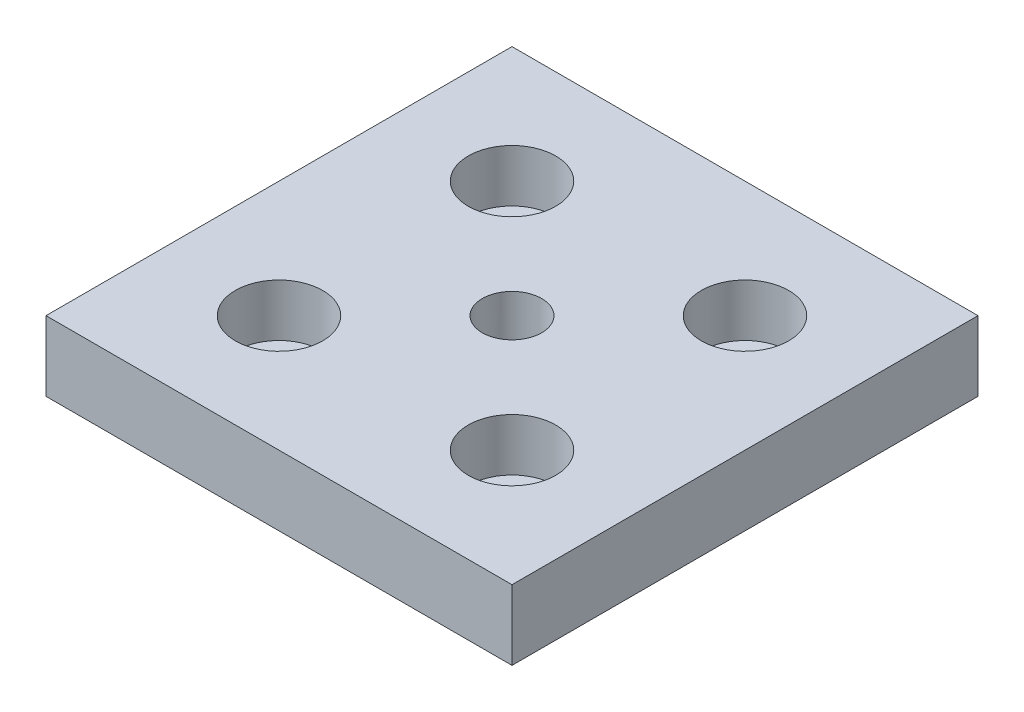
ISO-10303-21;
HEADER;
FILE_DESCRIPTION(('STEP AP214'),'2;1');
FILE_NAME('part.step','',(''),(''),'','','');
FILE_SCHEMA(('AUTOMOTIVE_DESIGN { 1 0 10303 214 1 1 1 1 }'));
ENDSEC;
DATA;
#1=APPLICATION_CONTEXT('core data for automotive mechanical design processes');
#2=APPLICATION_PROTOCOL_DEFINITION('international standard','automotive_design',2000,#1);
#3=PRODUCT_CONTEXT('',#1,'mechanical');
#4=PRODUCT('Part','Part','',(#3));
#5=PRODUCT_RELATED_PRODUCT_CATEGORY('part','',(#4));
#6=PRODUCT_DEFINITION_FORMATION('','',#4);
#7=PRODUCT_DEFINITION_CONTEXT('part definition',#1,'design');
#8=PRODUCT_DEFINITION('design','',#6,#7);
#9=PRODUCT_DEFINITION_SHAPE('','',#8);
#10=(LENGTH_UNIT() NAMED_UNIT(*) SI_UNIT(.MILLI.,.METRE.));
#11=(NAMED_UNIT(*) PLANE_ANGLE_UNIT() SI_UNIT($,.RADIAN.));
#12=(NAMED_UNIT(*) SI_UNIT($,.STERADIAN.) SOLID_ANGLE_UNIT());
#13=UNCERTAINTY_MEASURE_WITH_UNIT(LENGTH_MEASURE(1.E-05),#10,'distance_accuracy_value','');
#14=(GEOMETRIC_REPRESENTATION_CONTEXT(3) GLOBAL_UNCERTAINTY_ASSIGNED_CONTEXT((#13)) GLOBAL_UNIT_ASSIGNED_CONTEXT((#10,
#11,#12)) REPRESENTATION_CONTEXT('',''));
#15=CARTESIAN_POINT('',(0.,0.,0.));
#16=DIRECTION('',(0.,0.,1.));
#17=DIRECTION('',(1.,0.,0.));
#18=AXIS2_PLACEMENT_3D('',#15,#16,#17);
#19=CARTESIAN_POINT('',(-20.,0.,-20.));
#20=DIRECTION('',(0.,1.,0.));
#21=DIRECTION('',(0.,0.,1.));
#22=AXIS2_PLACEMENT_3D('',#19,#20,#21);
#23=CYLINDRICAL_SURFACE('',#22,4.5);
#24=CARTESIAN_POINT('',(-20.,0.,-20.));
#25=DIRECTION('',(0.,1.,0.));
#26=DIRECTION('',(0.,0.,1.));
#27=AXIS2_PLACEMENT_3D('',#24,#25,#26);
#28=CIRCLE('',#27,4.5);
#29=CARTESIAN_POINT('',(-20.,0.,-15.5));
#30=VERTEX_POINT('',#29);
#31=EDGE_CURVE('E137',#30,#30,#28,.T.);
#32=ORIENTED_EDGE('',*,*,#31,.F.);
#33=EDGE_LOOP('',(#32));
#34=FACE_BOUND('',#33,.T.);
#35=CARTESIAN_POINT('',(-20.,3.,-20.));
#36=DIRECTION('',(0.,1.,0.));
#37=DIRECTION('',(0.,0.,1.));
#38=AXIS2_PLACEMENT_3D('',#35,#36,#37);
#39=CIRCLE('',#38,4.5);
#40=CARTESIAN_POINT('',(-20.,3.,-15.5));
#41=VERTEX_POINT('',#40);
#42=EDGE_CURVE('E41',#41,#41,#39,.F.);
#43=ORIENTED_EDGE('',*,*,#42,.F.);
#44=EDGE_LOOP('',(#43));
#45=FACE_BOUND('',#44,.T.);
#46=ADVANCED_FACE('F37',(#34,#45),#23,.F.);
#47=CARTESIAN_POINT('',(20.,0.,-20.));
#48=DIRECTION('',(0.,1.,0.));
#49=DIRECTION('',(0.,0.,1.));
#50=AXIS2_PLACEMENT_3D('',#47,#48,#49);
#51=CYLINDRICAL_SURFACE('',#50,4.5);
#52=CARTESIAN_POINT('',(20.,0.,-20.));
#53=DIRECTION('',(0.,1.,0.));
#54=DIRECTION('',(0.,0.,1.));
#55=AXIS2_PLACEMENT_3D('',#52,#53,#54);
#56=CIRCLE('',#55,4.5);
#57=CARTESIAN_POINT('',(20.,0.,-15.5));
#58=VERTEX_POINT('',#57);
#59=EDGE_CURVE('E133',#58,#58,#56,.T.);
#60=ORIENTED_EDGE('',*,*,#59,.F.);
#61=EDGE_LOOP('',(#60));
#62=FACE_BOUND('',#61,.T.);
#63=CARTESIAN_POINT('',(20.,3.,-20.));
#64=DIRECTION('',(0.,1.,0.));
#65=DIRECTION('',(0.,0.,1.));
#66=AXIS2_PLACEMENT_3D('',#63,#64,#65);
#67=CIRCLE('',#66,4.5);
#68=CARTESIAN_POINT('',(20.,3.,-15.5));
#69=VERTEX_POINT('',#68);
#70=EDGE_CURVE('E119',#69,#69,#67,.F.);
#71=ORIENTED_EDGE('',*,*,#70,.F.);
#72=EDGE_LOOP('',(#71));
#73=FACE_BOUND('',#72,.T.);
#74=ADVANCED_FACE('F165',(#62,#73),#51,.F.);
#75=CARTESIAN_POINT('',(20.,0.,20.));
#76=DIRECTION('',(0.,1.,0.));
#77=DIRECTION('',(0.,0.,1.));
#78=AXIS2_PLACEMENT_3D('',#75,#76,#77);
#79=CYLINDRICAL_SURFACE('',#78,4.5);
#80=CARTESIAN_POINT('',(20.,0.,20.));
#81=DIRECTION('',(0.,1.,0.));
#82=DIRECTION('',(0.,0.,1.));
#83=AXIS2_PLACEMENT_3D('',#80,#81,#82);
#84=CIRCLE('',#83,4.5);
#85=CARTESIAN_POINT('',(20.,0.,24.5));
#86=VERTEX_POINT('',#85);
#87=EDGE_CURVE('E128',#86,#86,#84,.T.);
#88=ORIENTED_EDGE('',*,*,#87,.F.);
#89=EDGE_LOOP('',(#88));
#90=FACE_BOUND('',#89,.T.);
#91=CARTESIAN_POINT('',(20.,3.,20.));
#92=DIRECTION('',(0.,1.,0.));
#93=DIRECTION('',(0.,0.,1.));
#94=AXIS2_PLACEMENT_3D('',#91,#92,#93);
#95=CIRCLE('',#94,4.5);
#96=CARTESIAN_POINT('',(20.,3.,24.5));
#97=VERTEX_POINT('',#96);
#98=EDGE_CURVE('E116',#97,#97,#95,.F.);
#99=ORIENTED_EDGE('',*,*,#98,.F.);
#100=EDGE_LOOP('',(#99));
#101=FACE_BOUND('',#100,.T.);
#102=ADVANCED_FACE('F171',(#90,#101),#79,.F.);
#103=CARTESIAN_POINT('',(-20.,0.,20.));
#104=DIRECTION('',(0.,1.,0.));
#105=DIRECTION('',(0.,0.,1.));
#106=AXIS2_PLACEMENT_3D('',#103,#104,#105);
#107=CYLINDRICAL_SURFACE('',#106,4.5);
#108=CARTESIAN_POINT('',(-20.,0.,20.));
#109=DIRECTION('',(0.,1.,0.));
#110=DIRECTION('',(0.,0.,1.));
#111=AXIS2_PLACEMENT_3D('',#108,#109,#110);
#112=CIRCLE('',#111,4.5);
#113=CARTESIAN_POINT('',(-20.,0.,24.5));
#114=VERTEX_POINT('',#113);
#115=EDGE_CURVE('E124',#114,#114,#112,.T.);
#116=ORIENTED_EDGE('',*,*,#115,.F.);
#117=EDGE_LOOP('',(#116));
#118=FACE_BOUND('',#117,.T.);
#119=CARTESIAN_POINT('',(-20.,3.,20.));
#120=DIRECTION('',(0.,1.,0.));
#121=DIRECTION('',(0.,0.,1.));
#122=AXIS2_PLACEMENT_3D('',#119,#120,#121);
#123=CIRCLE('',#122,4.5);
#124=CARTESIAN_POINT('',(-20.,3.,24.5));
#125=VERTEX_POINT('',#124);
#126=EDGE_CURVE('E113',#125,#125,#123,.F.);
#127=ORIENTED_EDGE('',*,*,#126,.F.);
#128=EDGE_LOOP('',(#127));
#129=FACE_BOUND('',#128,.T.);
#130=ADVANCED_FACE('F178',(#118,#129),#107,.F.);
#131=CARTESIAN_POINT('',(40.,12.,40.));
#132=DIRECTION('',(-1.,0.,0.));
#133=DIRECTION('',(0.,0.,1.));
#134=AXIS2_PLACEMENT_3D('',#131,#132,#133);
#135=PLANE('',#134);
#136=DIRECTION('',(0.,0.,-1.));
#137=VECTOR('',#136,1.);
#138=CARTESIAN_POINT('',(40.,0.,40.));
#139=LINE('',#138,#137);
#140=CARTESIAN_POINT('',(40.,0.,40.));
#141=VERTEX_POINT('',#140);
#142=CARTESIAN_POINT('',(40.,0.,-40.));
#143=VERTEX_POINT('',#142);
#144=EDGE_CURVE('E104',#141,#143,#139,.T.);
#145=ORIENTED_EDGE('',*,*,#144,.T.);
#146=DIRECTION('',(0.,-1.,0.));
#147=VECTOR('',#146,1.);
#148=CARTESIAN_POINT('',(40.,12.,-40.));
#149=LINE('',#148,#147);
#150=CARTESIAN_POINT('',(40.,12.,-40.));
#151=VERTEX_POINT('',#150);
#152=EDGE_CURVE('E11',#151,#143,#149,.T.);
#153=ORIENTED_EDGE('',*,*,#152,.F.);
#154=DIRECTION('',(0.,0.,-1.));
#155=VECTOR('',#154,1.);
#156=CARTESIAN_POINT('',(40.,12.,40.));
#157=LINE('',#156,#155);
#158=CARTESIAN_POINT('',(40.,12.,40.));
#159=VERTEX_POINT('',#158);
#160=EDGE_CURVE('E91',#159,#151,#157,.T.);
#161=ORIENTED_EDGE('',*,*,#160,.F.);
#162=DIRECTION('',(0.,-1.,0.));
#163=VECTOR('',#162,1.);
#164=CARTESIAN_POINT('',(40.,12.,40.));
#165=LINE('',#164,#163);
#166=EDGE_CURVE('E100',#159,#141,#165,.T.);
#167=ORIENTED_EDGE('',*,*,#166,.T.);
#168=EDGE_LOOP('',(#145,#153,#161,#167));
#169=FACE_BOUND('',#168,.T.);
#170=ADVANCED_FACE('F39',(#169),#135,.F.);
#171=CARTESIAN_POINT('',(-40.,12.,-40.));
#172=DIRECTION('',(0.,0.,1.));
#173=DIRECTION('',(1.,0.,0.));
#174=AXIS2_PLACEMENT_3D('',#171,#172,#173);
#175=PLANE('',#174);
#176=DIRECTION('',(-1.,0.,0.));
#177=VECTOR('',#176,1.);
#178=CARTESIAN_POINT('',(-40.,0.,-40.));
#179=LINE('',#178,#177);
#180=CARTESIAN_POINT('',(-40.,0.,-40.));
#181=VERTEX_POINT('',#180);
#182=EDGE_CURVE('E95',#143,#181,#179,.T.);
#183=ORIENTED_EDGE('',*,*,#182,.T.);
#184=DIRECTION('',(0.,-1.,0.));
#185=VECTOR('',#184,1.);
#186=CARTESIAN_POINT('',(-40.,12.,-40.));
#187=LINE('',#186,#185);
#188=CARTESIAN_POINT('',(-40.,12.,-40.));
#189=VERTEX_POINT('',#188);
#190=EDGE_CURVE('E47',#189,#181,#187,.T.);
#191=ORIENTED_EDGE('',*,*,#190,.F.);
#192=DIRECTION('',(-1.,0.,0.));
#193=VECTOR('',#192,1.);
#194=CARTESIAN_POINT('',(-40.,12.,-40.));
#195=LINE('',#194,#193);
#196=EDGE_CURVE('E86',#151,#189,#195,.T.);
#197=ORIENTED_EDGE('',*,*,#196,.F.);
#198=ORIENTED_EDGE('',*,*,#152,.T.);
#199=EDGE_LOOP('',(#183,#191,#197,#198));
#200=FACE_BOUND('',#199,.T.);
#201=ADVANCED_FACE('F94',(#200),#175,.F.);
#202=CARTESIAN_POINT('',(-40.,12.,40.));
#203=DIRECTION('',(1.,0.,0.));
#204=DIRECTION('',(0.,0.,-1.));
#205=AXIS2_PLACEMENT_3D('',#202,#203,#204);
#206=PLANE('',#205);
#207=DIRECTION('',(0.,0.,1.));
#208=VECTOR('',#207,1.);
#209=CARTESIAN_POINT('',(-40.,0.,40.));
#210=LINE('',#209,#208);
#211=CARTESIAN_POINT('',(-40.,0.,40.));
#212=VERTEX_POINT('',#211);
#213=EDGE_CURVE('E73',#181,#212,#210,.T.);
#214=ORIENTED_EDGE('',*,*,#213,.T.);
#215=DIRECTION('',(0.,-1.,0.));
#216=VECTOR('',#215,1.);
#217=CARTESIAN_POINT('',(-40.,12.,40.));
#218=LINE('',#217,#216);
#219=CARTESIAN_POINT('',(-40.,12.,40.));
#220=VERTEX_POINT('',#219);
#221=EDGE_CURVE('E96',#220,#212,#218,.T.);
#222=ORIENTED_EDGE('',*,*,#221,.F.);
#223=DIRECTION('',(0.,0.,1.));
#224=VECTOR('',#223,1.);
#225=CARTESIAN_POINT('',(-40.,12.,40.));
#226=LINE('',#225,#224);
#227=EDGE_CURVE('E89',#189,#220,#226,.T.);
#228=ORIENTED_EDGE('',*,*,#227,.F.);
#229=ORIENTED_EDGE('',*,*,#190,.T.);
#230=EDGE_LOOP('',(#214,#222,#228,#229));
#231=FACE_BOUND('',#230,.T.);
#232=ADVANCED_FACE('F98',(#231),#206,.F.);
#233=CARTESIAN_POINT('',(-40.,12.,40.));
#234=DIRECTION('',(0.,0.,-1.));
#235=DIRECTION('',(-1.,0.,0.));
#236=AXIS2_PLACEMENT_3D('',#233,#234,#235);
#237=PLANE('',#236);
#238=DIRECTION('',(1.,0.,0.));
#239=VECTOR('',#238,1.);
#240=CARTESIAN_POINT('',(-40.,0.,40.));
#241=LINE('',#240,#239);
#242=EDGE_CURVE('E79',#212,#141,#241,.T.);
#243=ORIENTED_EDGE('',*,*,#242,.T.);
#244=ORIENTED_EDGE('',*,*,#166,.F.);
#245=DIRECTION('',(1.,0.,0.));
#246=VECTOR('',#245,1.);
#247=CARTESIAN_POINT('',(-40.,12.,40.));
#248=LINE('',#247,#246);
#249=EDGE_CURVE('E56',#220,#159,#248,.T.);
#250=ORIENTED_EDGE('',*,*,#249,.F.);
#251=ORIENTED_EDGE('',*,*,#221,.T.);
#252=EDGE_LOOP('',(#243,#244,#250,#251));
#253=FACE_BOUND('',#252,.T.);
#254=ADVANCED_FACE('F154',(#253),#237,.F.);
#255=CARTESIAN_POINT('',(0.,12.,0.));
#256=DIRECTION('',(0.,-1.,0.));
#257=DIRECTION('',(0.,0.,-1.));
#258=AXIS2_PLACEMENT_3D('',#255,#256,#257);
#259=PLANE('',#258);
#260=CARTESIAN_POINT('',(-20.,12.,20.));
#261=DIRECTION('',(0.,1.,0.));
#262=DIRECTION('',(0.,0.,1.));
#263=AXIS2_PLACEMENT_3D('',#260,#261,#262);
#264=CIRCLE('',#263,7.5);
#265=CARTESIAN_POINT('',(-20.,12.,27.5));
#266=VERTEX_POINT('',#265);
#267=EDGE_CURVE('E255',#266,#266,#264,.T.);
#268=ORIENTED_EDGE('',*,*,#267,.F.);
#269=EDGE_LOOP('',(#268));
#270=FACE_BOUND('',#269,.T.);
#271=CARTESIAN_POINT('',(20.,12.,20.));
#272=DIRECTION('',(0.,1.,0.));
#273=DIRECTION('',(0.,0.,1.));
#274=AXIS2_PLACEMENT_3D('',#271,#272,#273);
#275=CIRCLE('',#274,7.5);
#276=CARTESIAN_POINT('',(20.,12.,27.5));
#277=VERTEX_POINT('',#276);
#278=EDGE_CURVE('E250',#277,#277,#275,.T.);
#279=ORIENTED_EDGE('',*,*,#278,.F.);
#280=EDGE_LOOP('',(#279));
#281=FACE_BOUND('',#280,.T.);
#282=CARTESIAN_POINT('',(20.,12.,-20.));
#283=DIRECTION('',(0.,1.,0.));
#284=DIRECTION('',(0.,0.,1.));
#285=AXIS2_PLACEMENT_3D('',#282,#283,#284);
#286=CIRCLE('',#285,7.5);
#287=CARTESIAN_POINT('',(20.,12.,-12.5));
#288=VERTEX_POINT('',#287);
#289=EDGE_CURVE('E241',#288,#288,#286,.T.);
#290=ORIENTED_EDGE('',*,*,#289,.F.);
#291=EDGE_LOOP('',(#290));
#292=FACE_BOUND('',#291,.T.);
#293=CARTESIAN_POINT('',(-20.,12.,-20.));
#294=DIRECTION('',(0.,1.,0.));
#295=DIRECTION('',(0.,0.,1.));
#296=AXIS2_PLACEMENT_3D('',#293,#294,#295);
#297=CIRCLE('',#296,7.5);
#298=CARTESIAN_POINT('',(-20.,12.,-12.5));
#299=VERTEX_POINT('',#298);
#300=EDGE_CURVE('E240',#299,#299,#297,.T.);
#301=ORIENTED_EDGE('',*,*,#300,.F.);
#302=EDGE_LOOP('',(#301));
#303=FACE_BOUND('',#302,.T.);
#304=CARTESIAN_POINT('',(0.,12.,0.));
#305=DIRECTION('',(0.,1.,0.));
#306=DIRECTION('',(0.,0.,1.));
#307=AXIS2_PLACEMENT_3D('',#304,#305,#306);
#308=CIRCLE('',#307,5.1);
#309=CARTESIAN_POINT('',(0.,12.,5.1));
#310=VERTEX_POINT('',#309);
#311=EDGE_CURVE('E140',#310,#310,#308,.T.);
#312=ORIENTED_EDGE('',*,*,#311,.F.);
#313=EDGE_LOOP('',(#312));
#314=FACE_BOUND('',#313,.T.);
#315=ORIENTED_EDGE('',*,*,#160,.T.);
#316=ORIENTED_EDGE('',*,*,#196,.T.);
#317=ORIENTED_EDGE('',*,*,#227,.T.);
#318=ORIENTED_EDGE('',*,*,#249,.T.);
#319=EDGE_LOOP('',(#315,#316,#317,#318));
#320=FACE_BOUND('',#319,.T.);
#321=ADVANCED_FACE('F87',(#270,#281,#292,#303,#314,#320),#259,.F.);
#322=CARTESIAN_POINT('',(0.,0.,0.));
#323=DIRECTION('',(0.,-1.,0.));
#324=DIRECTION('',(0.,0.,-1.));
#325=AXIS2_PLACEMENT_3D('',#322,#323,#324);
#326=PLANE('',#325);
#327=ORIENTED_EDGE('',*,*,#115,.T.);
#328=EDGE_LOOP('',(#327));
#329=FACE_BOUND('',#328,.T.);
#330=ORIENTED_EDGE('',*,*,#87,.T.);
#331=EDGE_LOOP('',(#330));
#332=FACE_BOUND('',#331,.T.);
#333=ORIENTED_EDGE('',*,*,#59,.T.);
#334=EDGE_LOOP('',(#333));
#335=FACE_BOUND('',#334,.T.);
#336=ORIENTED_EDGE('',*,*,#31,.T.);
#337=EDGE_LOOP('',(#336));
#338=FACE_BOUND('',#337,.T.);
#339=CARTESIAN_POINT('',(0.,0.,0.));
#340=DIRECTION('',(0.,-1.,0.));
#341=DIRECTION('',(0.,0.,-1.));
#342=AXIS2_PLACEMENT_3D('',#339,#340,#341);
#343=CIRCLE('',#342,5.1);
#344=CARTESIAN_POINT('',(0.,0.,-5.1));
#345=VERTEX_POINT('',#344);
#346=EDGE_CURVE('E107',#345,#345,#343,.T.);
#347=ORIENTED_EDGE('',*,*,#346,.F.);
#348=EDGE_LOOP('',(#347));
#349=FACE_BOUND('',#348,.T.);
#350=ORIENTED_EDGE('',*,*,#144,.F.);
#351=ORIENTED_EDGE('',*,*,#242,.F.);
#352=ORIENTED_EDGE('',*,*,#213,.F.);
#353=ORIENTED_EDGE('',*,*,#182,.F.);
#354=EDGE_LOOP('',(#350,#351,#352,#353));
#355=FACE_BOUND('',#354,.T.);
#356=ADVANCED_FACE('F148',(#329,#332,#335,#338,#349,#355),#326,.T.);
#357=CARTESIAN_POINT('',(0.,12.,0.));
#358=DIRECTION('',(0.,1.,0.));
#359=DIRECTION('',(0.,0.,1.));
#360=AXIS2_PLACEMENT_3D('',#357,#358,#359);
#361=CYLINDRICAL_SURFACE('',#360,5.1);
#362=ORIENTED_EDGE('',*,*,#311,.T.);
#363=EDGE_LOOP('',(#362));
#364=FACE_BOUND('',#363,.T.);
#365=ORIENTED_EDGE('',*,*,#346,.T.);
#366=EDGE_LOOP('',(#365));
#367=FACE_BOUND('',#366,.T.);
#368=ADVANCED_FACE('F146',(#364,#367),#361,.F.);
#369=CARTESIAN_POINT('',(-20.,3.,20.));
#370=DIRECTION('',(0.,1.,0.));
#371=DIRECTION('',(0.,0.,1.));
#372=AXIS2_PLACEMENT_3D('',#369,#370,#371);
#373=PLANE('',#372);
#374=CARTESIAN_POINT('',(-20.,3.,20.));
#375=DIRECTION('',(0.,1.,0.));
#376=DIRECTION('',(0.,0.,1.));
#377=AXIS2_PLACEMENT_3D('',#374,#375,#376);
#378=CIRCLE('',#377,7.5);
#379=CARTESIAN_POINT('',(-20.,3.,27.5));
#380=VERTEX_POINT('',#379);
#381=EDGE_CURVE('E253',#380,#380,#378,.T.);
#382=ORIENTED_EDGE('',*,*,#381,.T.);
#383=EDGE_LOOP('',(#382));
#384=FACE_BOUND('',#383,.T.);
#385=ORIENTED_EDGE('',*,*,#126,.T.);
#386=EDGE_LOOP('',(#385));
#387=FACE_BOUND('',#386,.T.);
#388=ADVANCED_FACE('F181',(#384,#387),#373,.T.);
#389=CARTESIAN_POINT('',(-20.,3.,20.));
#390=DIRECTION('',(0.,1.,0.));
#391=DIRECTION('',(0.,0.,1.));
#392=AXIS2_PLACEMENT_3D('',#389,#390,#391);
#393=CYLINDRICAL_SURFACE('',#392,7.5);
#394=ORIENTED_EDGE('',*,*,#381,.F.);
#395=EDGE_LOOP('',(#394));
#396=FACE_BOUND('',#395,.T.);
#397=ORIENTED_EDGE('',*,*,#267,.T.);
#398=EDGE_LOOP('',(#397));
#399=FACE_BOUND('',#398,.T.);
#400=ADVANCED_FACE('F186',(#396,#399),#393,.F.);
#401=CARTESIAN_POINT('',(20.,3.,20.));
#402=DIRECTION('',(0.,1.,0.));
#403=DIRECTION('',(0.,0.,1.));
#404=AXIS2_PLACEMENT_3D('',#401,#402,#403);
#405=PLANE('',#404);
#406=CARTESIAN_POINT('',(20.,3.,20.));
#407=DIRECTION('',(0.,1.,0.));
#408=DIRECTION('',(0.,0.,1.));
#409=AXIS2_PLACEMENT_3D('',#406,#407,#408);
#410=CIRCLE('',#409,7.5);
#411=CARTESIAN_POINT('',(20.,3.,27.5));
#412=VERTEX_POINT('',#411);
#413=EDGE_CURVE('E246',#412,#412,#410,.T.);
#414=ORIENTED_EDGE('',*,*,#413,.T.);
#415=EDGE_LOOP('',(#414));
#416=FACE_BOUND('',#415,.T.);
#417=ORIENTED_EDGE('',*,*,#98,.T.);
#418=EDGE_LOOP('',(#417));
#419=FACE_BOUND('',#418,.T.);
#420=ADVANCED_FACE('F194',(#416,#419),#405,.T.);
#421=CARTESIAN_POINT('',(20.,3.,20.));
#422=DIRECTION('',(0.,1.,0.));
#423=DIRECTION('',(0.,0.,1.));
#424=AXIS2_PLACEMENT_3D('',#421,#422,#423);
#425=CYLINDRICAL_SURFACE('',#424,7.5);
#426=ORIENTED_EDGE('',*,*,#413,.F.);
#427=EDGE_LOOP('',(#426));
#428=FACE_BOUND('',#427,.T.);
#429=ORIENTED_EDGE('',*,*,#278,.T.);
#430=EDGE_LOOP('',(#429));
#431=FACE_BOUND('',#430,.T.);
#432=ADVANCED_FACE('F200',(#428,#431),#425,.F.);
#433=CARTESIAN_POINT('',(20.,3.,-20.));
#434=DIRECTION('',(0.,1.,0.));
#435=DIRECTION('',(0.,0.,1.));
#436=AXIS2_PLACEMENT_3D('',#433,#434,#435);
#437=PLANE('',#436);
#438=CARTESIAN_POINT('',(20.,3.,-20.));
#439=DIRECTION('',(0.,1.,0.));
#440=DIRECTION('',(0.,0.,1.));
#441=AXIS2_PLACEMENT_3D('',#438,#439,#440);
#442=CIRCLE('',#441,7.5);
#443=CARTESIAN_POINT('',(20.,3.,-12.5));
#444=VERTEX_POINT('',#443);
#445=EDGE_CURVE('E239',#444,#444,#442,.T.);
#446=ORIENTED_EDGE('',*,*,#445,.T.);
#447=EDGE_LOOP('',(#446));
#448=FACE_BOUND('',#447,.T.);
#449=ORIENTED_EDGE('',*,*,#70,.T.);
#450=EDGE_LOOP('',(#449));
#451=FACE_BOUND('',#450,.T.);
#452=ADVANCED_FACE('F226',(#448,#451),#437,.T.);
#453=CARTESIAN_POINT('',(20.,3.,-20.));
#454=DIRECTION('',(0.,1.,0.));
#455=DIRECTION('',(0.,0.,1.));
#456=AXIS2_PLACEMENT_3D('',#453,#454,#455);
#457=CYLINDRICAL_SURFACE('',#456,7.5);
#458=ORIENTED_EDGE('',*,*,#445,.F.);
#459=EDGE_LOOP('',(#458));
#460=FACE_BOUND('',#459,.T.);
#461=ORIENTED_EDGE('',*,*,#289,.T.);
#462=EDGE_LOOP('',(#461));
#463=FACE_BOUND('',#462,.T.);
#464=ADVANCED_FACE('F207',(#460,#463),#457,.F.);
#465=CARTESIAN_POINT('',(-20.,3.,-20.));
#466=DIRECTION('',(0.,1.,0.));
#467=DIRECTION('',(0.,0.,1.));
#468=AXIS2_PLACEMENT_3D('',#465,#466,#467);
#469=PLANE('',#468);
#470=CARTESIAN_POINT('',(-20.,3.,-20.));
#471=DIRECTION('',(0.,1.,0.));
#472=DIRECTION('',(0.,0.,1.));
#473=AXIS2_PLACEMENT_3D('',#470,#471,#472);
#474=CIRCLE('',#473,7.5);
#475=CARTESIAN_POINT('',(-20.,3.,-12.5));
#476=VERTEX_POINT('',#475);
#477=EDGE_CURVE('E117',#476,#476,#474,.T.);
#478=ORIENTED_EDGE('',*,*,#477,.T.);
#479=EDGE_LOOP('',(#478));
#480=FACE_BOUND('',#479,.T.);
#481=ORIENTED_EDGE('',*,*,#42,.T.);
#482=EDGE_LOOP('',(#481));
#483=FACE_BOUND('',#482,.T.);
#484=ADVANCED_FACE('F203',(#480,#483),#469,.T.);
#485=CARTESIAN_POINT('',(-20.,3.,-20.));
#486=DIRECTION('',(0.,1.,0.));
#487=DIRECTION('',(0.,0.,1.));
#488=AXIS2_PLACEMENT_3D('',#485,#486,#487);
#489=CYLINDRICAL_SURFACE('',#488,7.5);
#490=ORIENTED_EDGE('',*,*,#477,.F.);
#491=EDGE_LOOP('',(#490));
#492=FACE_BOUND('',#491,.T.);
#493=ORIENTED_EDGE('',*,*,#300,.T.);
#494=EDGE_LOOP('',(#493));
#495=FACE_BOUND('',#494,.T.);
#496=ADVANCED_FACE('F206',(#492,#495),#489,.F.);
#497=CLOSED_SHELL('',(#46,#74,#102,#130,#170,#201,#232,#254,#321,#356,#368,#388,#400,#420,#432,
#452,#464,#484,#496));
#498=MANIFOLD_SOLID_BREP('B2',#497);
#499=ADVANCED_BREP_SHAPE_REPRESENTATION('',(#18,#498),#14);
#500=SHAPE_DEFINITION_REPRESENTATION(#9,#499);
ENDSEC;
END-ISO-10303-21;
